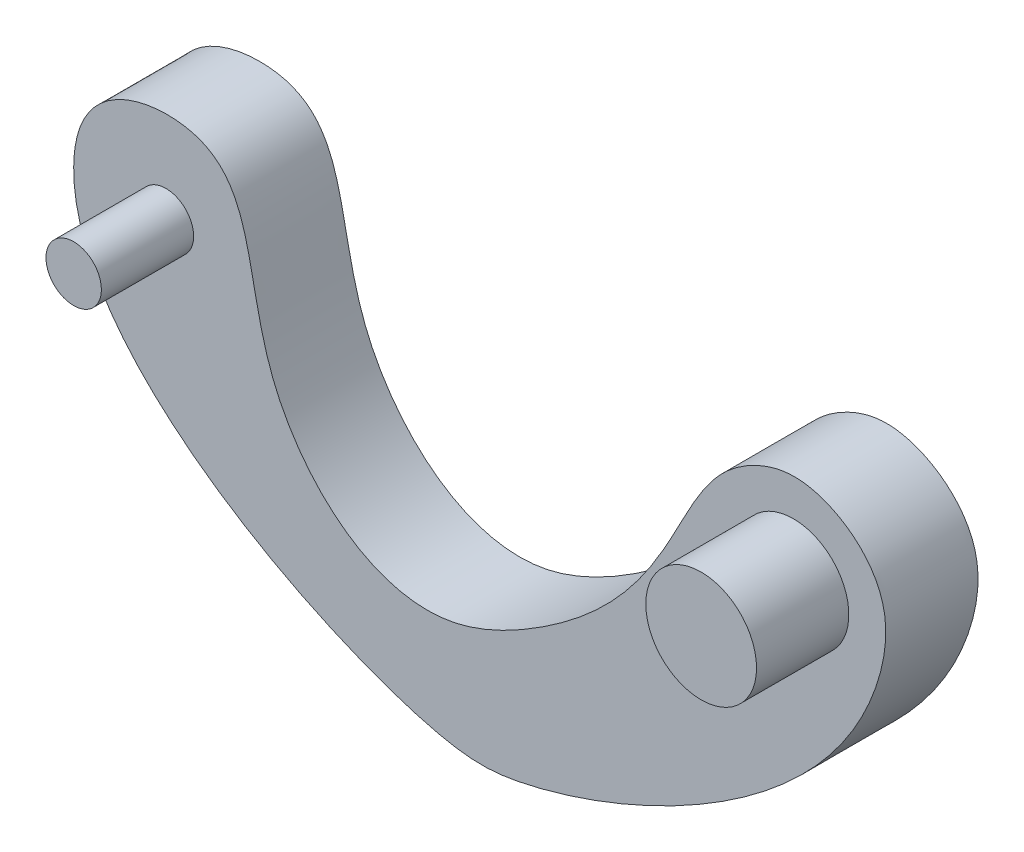
ISO-10303-21;
HEADER;
FILE_DESCRIPTION(('STEP AP214'),'2;1');
FILE_NAME('part.step','',(''),(''),'','','');
FILE_SCHEMA(('AUTOMOTIVE_DESIGN { 1 0 10303 214 1 1 1 1 }'));
ENDSEC;
DATA;
#1=APPLICATION_CONTEXT('core data for automotive mechanical design processes');
#2=APPLICATION_PROTOCOL_DEFINITION('international standard','automotive_design',2000,#1);
#3=PRODUCT_CONTEXT('',#1,'mechanical');
#4=PRODUCT('Part','Part','',(#3));
#5=PRODUCT_RELATED_PRODUCT_CATEGORY('part','',(#4));
#6=PRODUCT_DEFINITION_FORMATION('','',#4);
#7=PRODUCT_DEFINITION_CONTEXT('part definition',#1,'design');
#8=PRODUCT_DEFINITION('design','',#6,#7);
#9=PRODUCT_DEFINITION_SHAPE('','',#8);
#10=(LENGTH_UNIT() NAMED_UNIT(*) SI_UNIT(.MILLI.,.METRE.));
#11=(NAMED_UNIT(*) PLANE_ANGLE_UNIT() SI_UNIT($,.RADIAN.));
#12=(NAMED_UNIT(*) SI_UNIT($,.STERADIAN.) SOLID_ANGLE_UNIT());
#13=UNCERTAINTY_MEASURE_WITH_UNIT(LENGTH_MEASURE(1.E-05),#10,'distance_accuracy_value','');
#14=(GEOMETRIC_REPRESENTATION_CONTEXT(3) GLOBAL_UNCERTAINTY_ASSIGNED_CONTEXT((#13)) GLOBAL_UNIT_ASSIGNED_CONTEXT((#10,
#11,#12)) REPRESENTATION_CONTEXT('',''));
#15=CARTESIAN_POINT('',(0.,0.,0.));
#16=DIRECTION('',(0.,0.,1.));
#17=DIRECTION('',(1.,0.,0.));
#18=AXIS2_PLACEMENT_3D('',#15,#16,#17);
#19=CARTESIAN_POINT('',(6.67179321729811,1.694657391281,2.5));
#20=DIRECTION('',(0.,0.,-1.));
#21=DIRECTION('',(-1.,0.,0.));
#22=AXIS2_PLACEMENT_3D('',#19,#20,#21);
#23=PLANE('',#22);
#24=CARTESIAN_POINT('',(8.5,0.,2.5));
#25=DIRECTION('',(0.,0.,-1.));
#26=DIRECTION('',(-1.,0.,0.));
#27=AXIS2_PLACEMENT_3D('',#24,#25,#26);
#28=CIRCLE('',#27,1.5);
#29=CARTESIAN_POINT('',(7.,0.,2.5));
#30=VERTEX_POINT('',#29);
#31=EDGE_CURVE('E38',#30,#30,#28,.F.);
#32=ORIENTED_EDGE('',*,*,#31,.F.);
#33=EDGE_LOOP('',(#32));
#34=FACE_BOUND('',#33,.T.);
#35=CARTESIAN_POINT('',(-11.,0.,2.5));
#36=CARTESIAN_POINT('',(-11.0483061305239,-4.37605090779364,2.5));
#37=CARTESIAN_POINT('',(-2.08943441252211,-8.6933984416828,2.5));
#38=CARTESIAN_POINT('',(2.77123054842767,-8.34946119289268,2.5));
#39=CARTESIAN_POINT('',(10.0771414934015,-5.05211067996077,2.5));
#40=CARTESIAN_POINT('',(11.3450696757332,1.28206983793938,2.5));
#41=CARTESIAN_POINT('',(9.06064496495261,2.78023212670289,2.5));
#42=CARTESIAN_POINT('',(5.01647809358986,1.57176918449295,2.5));
#43=CARTESIAN_POINT('',(5.87396271761155,-2.29988099501614,2.5));
#44=CARTESIAN_POINT('',(-1.70646961832908,-6.33612188427136,2.5));
#45=CARTESIAN_POINT('',(-4.35436506921168,-4.66332108451081,2.5));
#46=CARTESIAN_POINT('',(-6.46706129152875,-0.819337677707344,2.5));
#47=CARTESIAN_POINT('',(-5.97169701798191,2.35698829846779,2.5));
#48=CARTESIAN_POINT('',(-9.37347777190725,2.58533649216661,2.5));
#49=CARTESIAN_POINT('',(-10.8790101388148,1.75267103488794,2.5));
#50=CARTESIAN_POINT('',(-10.9980801568275,0.173918535117077,2.5));
#51=CARTESIAN_POINT('',(-11.,0.,2.5));
#52=B_SPLINE_CURVE_WITH_KNOTS('',3,(#35,#36,#37,#38,#39,#40,#41,#42,#43,#44,#45,#46,#47,#48,#49,
#50,#51),.UNSPECIFIED.,.T.,.F.,(4,1,1,1,1,1,1,1,1,1,1,1,1,1,4),(0.,0.143873669336932,
0.181231094929537,0.352202793593098,0.380710780471467,0.437802976834855,0.471514382317418,
0.684113429814535,0.720690809772995,0.800710801943557,0.823923962019719,0.929609250458449,
0.948537920361961,0.994281991151327,0.999999999999998),.UNSPECIFIED.);
#53=CARTESIAN_POINT('',(-11.,0.,2.5));
#54=VERTEX_POINT('',#53);
#55=EDGE_CURVE('E42',#54,#54,#52,.T.);
#56=ORIENTED_EDGE('',*,*,#55,.T.);
#57=EDGE_LOOP('',(#56));
#58=FACE_BOUND('',#57,.T.);
#59=CARTESIAN_POINT('',(-8.5,0.,2.5));
#60=DIRECTION('',(0.,0.,-1.));
#61=DIRECTION('',(-1.,0.,0.));
#62=AXIS2_PLACEMENT_3D('',#59,#60,#61);
#63=CIRCLE('',#62,0.75);
#64=CARTESIAN_POINT('',(-9.25,0.,2.5));
#65=VERTEX_POINT('',#64);
#66=EDGE_CURVE('E10',#65,#65,#63,.F.);
#67=ORIENTED_EDGE('',*,*,#66,.F.);
#68=EDGE_LOOP('',(#67));
#69=FACE_BOUND('',#68,.T.);
#70=ADVANCED_FACE('F30',(#34,#58,#69),#23,.F.);
#71=DIRECTION('',(0.,0.,-1.));
#72=VECTOR('',#71,1.);
#73=SURFACE_OF_LINEAR_EXTRUSION('',#52,#72);
#74=ORIENTED_EDGE('',*,*,#55,.F.);
#75=EDGE_LOOP('',(#74));
#76=FACE_BOUND('',#75,.T.);
#77=CARTESIAN_POINT('',(-11.,0.,0.));
#78=CARTESIAN_POINT('',(-11.0483061305239,-4.37605090779364,0.));
#79=CARTESIAN_POINT('',(-2.08943441252211,-8.6933984416828,0.));
#80=CARTESIAN_POINT('',(2.77123054842767,-8.34946119289268,0.));
#81=CARTESIAN_POINT('',(10.0771414934015,-5.05211067996077,0.));
#82=CARTESIAN_POINT('',(11.3450696757332,1.28206983793938,0.));
#83=CARTESIAN_POINT('',(9.06064496495261,2.78023212670289,0.));
#84=CARTESIAN_POINT('',(5.01647809358986,1.57176918449295,0.));
#85=CARTESIAN_POINT('',(5.87396271761155,-2.29988099501614,0.));
#86=CARTESIAN_POINT('',(-1.70646961832908,-6.33612188427136,0.));
#87=CARTESIAN_POINT('',(-4.35436506921168,-4.66332108451081,0.));
#88=CARTESIAN_POINT('',(-6.46706129152875,-0.819337677707344,0.));
#89=CARTESIAN_POINT('',(-5.97169701798191,2.35698829846779,0.));
#90=CARTESIAN_POINT('',(-9.37347777190725,2.58533649216661,0.));
#91=CARTESIAN_POINT('',(-10.8790101388148,1.75267103488794,0.));
#92=CARTESIAN_POINT('',(-10.9980801568275,0.173918535117077,0.));
#93=CARTESIAN_POINT('',(-11.,0.,0.));
#94=B_SPLINE_CURVE_WITH_KNOTS('',3,(#77,#78,#79,#80,#81,#82,#83,#84,#85,#86,#87,#88,#89,#90,#91,
#92,#93),.UNSPECIFIED.,.T.,.F.,(4,1,1,1,1,1,1,1,1,1,1,1,1,1,4),(0.,0.143873669336932,
0.181231094929537,0.352202793593098,0.380710780471467,0.437802976834855,0.471514382317418,
0.684113429814535,0.720690809772995,0.800710801943557,0.823923962019719,0.929609250458449,
0.948537920361961,0.994281991151327,0.999999999999998),.UNSPECIFIED.);
#95=CARTESIAN_POINT('',(-11.,0.,0.));
#96=VERTEX_POINT('',#95);
#97=EDGE_CURVE('E46',#96,#96,#94,.T.);
#98=ORIENTED_EDGE('',*,*,#97,.T.);
#99=EDGE_LOOP('',(#98));
#100=FACE_BOUND('',#99,.T.);
#101=ADVANCED_FACE('F32',(#76,#100),#73,.F.);
#102=CARTESIAN_POINT('',(6.67179321729811,1.694657391281,0.));
#103=DIRECTION('',(0.,0.,-1.));
#104=DIRECTION('',(-1.,0.,0.));
#105=AXIS2_PLACEMENT_3D('',#102,#103,#104);
#106=PLANE('',#105);
#107=CARTESIAN_POINT('',(8.5,0.,0.));
#108=DIRECTION('',(0.,0.,-1.));
#109=DIRECTION('',(-1.,0.,0.));
#110=AXIS2_PLACEMENT_3D('',#107,#108,#109);
#111=CIRCLE('',#110,0.75);
#112=CARTESIAN_POINT('',(7.75,0.,0.));
#113=VERTEX_POINT('',#112);
#114=EDGE_CURVE('E68',#113,#113,#111,.T.);
#115=ORIENTED_EDGE('',*,*,#114,.F.);
#116=EDGE_LOOP('',(#115));
#117=FACE_BOUND('',#116,.T.);
#118=ORIENTED_EDGE('',*,*,#97,.F.);
#119=EDGE_LOOP('',(#118));
#120=FACE_BOUND('',#119,.T.);
#121=ADVANCED_FACE('F83',(#117,#120),#106,.T.);
#122=CARTESIAN_POINT('',(8.5,0.,5.));
#123=DIRECTION('',(0.,0.,-1.));
#124=DIRECTION('',(-1.,0.,0.));
#125=AXIS2_PLACEMENT_3D('',#122,#123,#124);
#126=CYLINDRICAL_SURFACE('',#125,1.5);
#127=CARTESIAN_POINT('',(8.5,0.,5.));
#128=DIRECTION('',(0.,0.,1.));
#129=DIRECTION('',(1.,0.,0.));
#130=AXIS2_PLACEMENT_3D('',#127,#128,#129);
#131=CIRCLE('',#130,1.5);
#132=CARTESIAN_POINT('',(10.,0.,5.));
#133=VERTEX_POINT('',#132);
#134=EDGE_CURVE('E51',#133,#133,#131,.T.);
#135=ORIENTED_EDGE('',*,*,#134,.F.);
#136=EDGE_LOOP('',(#135));
#137=FACE_BOUND('',#136,.T.);
#138=ORIENTED_EDGE('',*,*,#31,.T.);
#139=EDGE_LOOP('',(#138));
#140=FACE_BOUND('',#139,.T.);
#141=ADVANCED_FACE('F86',(#137,#140),#126,.T.);
#142=CARTESIAN_POINT('',(8.5,0.,5.));
#143=DIRECTION('',(0.,0.,1.));
#144=DIRECTION('',(1.,0.,0.));
#145=AXIS2_PLACEMENT_3D('',#142,#143,#144);
#146=PLANE('',#145);
#147=ORIENTED_EDGE('',*,*,#134,.T.);
#148=EDGE_LOOP('',(#147));
#149=FACE_BOUND('',#148,.T.);
#150=ADVANCED_FACE('F104',(#149),#146,.T.);
#151=CARTESIAN_POINT('',(-8.5,0.,5.));
#152=DIRECTION('',(0.,0.,-1.));
#153=DIRECTION('',(-1.,0.,0.));
#154=AXIS2_PLACEMENT_3D('',#151,#152,#153);
#155=CYLINDRICAL_SURFACE('',#154,0.75);
#156=CARTESIAN_POINT('',(-8.5,0.,5.));
#157=DIRECTION('',(0.,0.,1.));
#158=DIRECTION('',(1.,0.,0.));
#159=AXIS2_PLACEMENT_3D('',#156,#157,#158);
#160=CIRCLE('',#159,0.75);
#161=CARTESIAN_POINT('',(-7.75,0.,5.));
#162=VERTEX_POINT('',#161);
#163=EDGE_CURVE('E64',#162,#162,#160,.T.);
#164=ORIENTED_EDGE('',*,*,#163,.F.);
#165=EDGE_LOOP('',(#164));
#166=FACE_BOUND('',#165,.T.);
#167=ORIENTED_EDGE('',*,*,#66,.T.);
#168=EDGE_LOOP('',(#167));
#169=FACE_BOUND('',#168,.T.);
#170=ADVANCED_FACE('F108',(#166,#169),#155,.T.);
#171=CARTESIAN_POINT('',(-8.5,0.,5.));
#172=DIRECTION('',(0.,0.,1.));
#173=DIRECTION('',(1.,0.,0.));
#174=AXIS2_PLACEMENT_3D('',#171,#172,#173);
#175=PLANE('',#174);
#176=ORIENTED_EDGE('',*,*,#163,.T.);
#177=EDGE_LOOP('',(#176));
#178=FACE_BOUND('',#177,.T.);
#179=ADVANCED_FACE('F79',(#178),#175,.T.);
#180=CARTESIAN_POINT('',(8.5,0.,2.));
#181=DIRECTION('',(0.,0.,-1.));
#182=DIRECTION('',(-1.,0.,0.));
#183=AXIS2_PLACEMENT_3D('',#180,#181,#182);
#184=CYLINDRICAL_SURFACE('',#183,0.75);
#185=CARTESIAN_POINT('',(8.5,0.,2.));
#186=DIRECTION('',(0.,0.,-1.));
#187=DIRECTION('',(-1.,0.,0.));
#188=AXIS2_PLACEMENT_3D('',#185,#186,#187);
#189=CIRCLE('',#188,0.75);
#190=CARTESIAN_POINT('',(7.75,0.,2.));
#191=VERTEX_POINT('',#190);
#192=EDGE_CURVE('E67',#191,#191,#189,.T.);
#193=ORIENTED_EDGE('',*,*,#192,.F.);
#194=EDGE_LOOP('',(#193));
#195=FACE_BOUND('',#194,.T.);
#196=ORIENTED_EDGE('',*,*,#114,.T.);
#197=EDGE_LOOP('',(#196));
#198=FACE_BOUND('',#197,.T.);
#199=ADVANCED_FACE('F76',(#195,#198),#184,.F.);
#200=CARTESIAN_POINT('',(8.5,0.,2.));
#201=DIRECTION('',(0.,0.,-1.));
#202=DIRECTION('',(-1.,0.,0.));
#203=AXIS2_PLACEMENT_3D('',#200,#201,#202);
#204=PLANE('',#203);
#205=ORIENTED_EDGE('',*,*,#192,.T.);
#206=EDGE_LOOP('',(#205));
#207=FACE_BOUND('',#206,.T.);
#208=ADVANCED_FACE('F74',(#207),#204,.T.);
#209=CLOSED_SHELL('',(#70,#101,#121,#141,#150,#170,#179,#199,#208));
#210=MANIFOLD_SOLID_BREP('B2',#209);
#211=ADVANCED_BREP_SHAPE_REPRESENTATION('',(#18,#210),#14);
#212=SHAPE_DEFINITION_REPRESENTATION(#9,#211);
ENDSEC;
END-ISO-10303-21;
